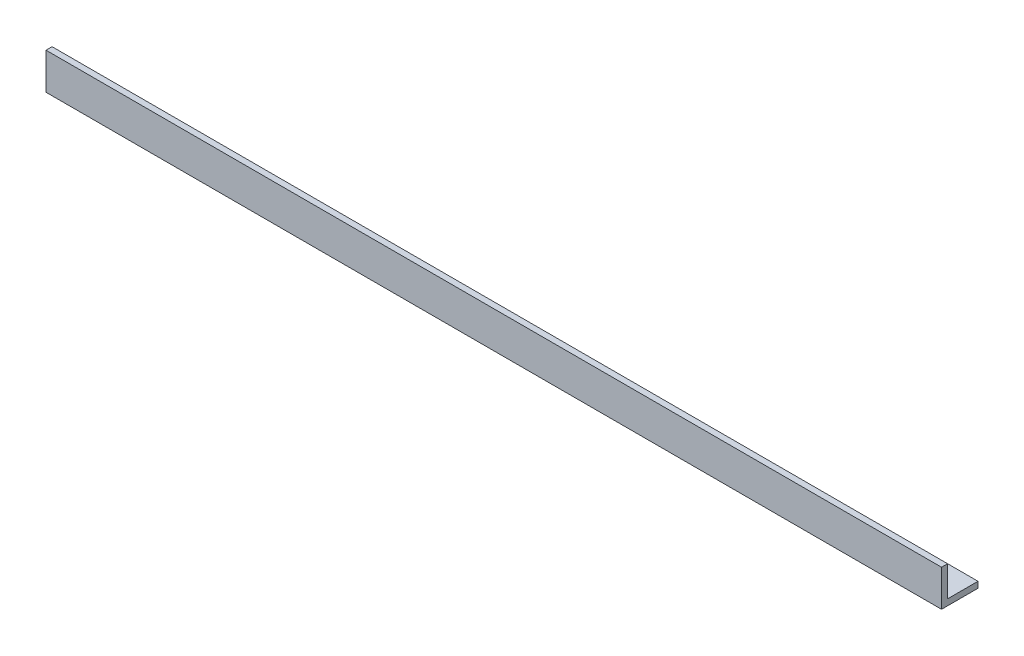
ISO-10303-21;
HEADER;
FILE_DESCRIPTION(('STEP AP214'),'2;1');
FILE_NAME('part.step','',(''),(''),'','','');
FILE_SCHEMA(('AUTOMOTIVE_DESIGN { 1 0 10303 214 1 1 1 1 }'));
ENDSEC;
DATA;
#1=APPLICATION_CONTEXT('core data for automotive mechanical design processes');
#2=APPLICATION_PROTOCOL_DEFINITION('international standard','automotive_design',2000,#1);
#3=PRODUCT_CONTEXT('',#1,'mechanical');
#4=PRODUCT('Part','Part','',(#3));
#5=PRODUCT_RELATED_PRODUCT_CATEGORY('part','',(#4));
#6=PRODUCT_DEFINITION_FORMATION('','',#4);
#7=PRODUCT_DEFINITION_CONTEXT('part definition',#1,'design');
#8=PRODUCT_DEFINITION('design','',#6,#7);
#9=PRODUCT_DEFINITION_SHAPE('','',#8);
#10=(LENGTH_UNIT() NAMED_UNIT(*) SI_UNIT(.MILLI.,.METRE.));
#11=(NAMED_UNIT(*) PLANE_ANGLE_UNIT() SI_UNIT($,.RADIAN.));
#12=(NAMED_UNIT(*) SI_UNIT($,.STERADIAN.) SOLID_ANGLE_UNIT());
#13=UNCERTAINTY_MEASURE_WITH_UNIT(LENGTH_MEASURE(1.E-05),#10,'distance_accuracy_value','');
#14=(GEOMETRIC_REPRESENTATION_CONTEXT(3) GLOBAL_UNCERTAINTY_ASSIGNED_CONTEXT((#13)) GLOBAL_UNIT_ASSIGNED_CONTEXT((#10,
#11,#12)) REPRESENTATION_CONTEXT('',''));
#15=CARTESIAN_POINT('',(0.,0.,0.));
#16=DIRECTION('',(0.,0.,1.));
#17=DIRECTION('',(1.,0.,0.));
#18=AXIS2_PLACEMENT_3D('',#15,#16,#17);
#19=CARTESIAN_POINT('',(-468.,0.,-19.05));
#20=DIRECTION('',(0.,-1.,0.));
#21=DIRECTION('',(0.,0.,-1.));
#22=AXIS2_PLACEMENT_3D('',#19,#20,#21);
#23=PLANE('',#22);
#24=CARTESIAN_POINT('',(-449.45,0.,-11.2735467227539));
#25=DIRECTION('',(0.,1.,0.));
#26=DIRECTION('',(0.,0.,1.));
#27=AXIS2_PLACEMENT_3D('',#24,#25,#26);
#28=CIRCLE('',#27,2.38125000000001);
#29=CARTESIAN_POINT('',(-449.45,0.,-8.89229672275387));
#30=VERTEX_POINT('',#29);
#31=EDGE_CURVE('E222',#30,#30,#28,.T.);
#32=ORIENTED_EDGE('',*,*,#31,.T.);
#33=EDGE_LOOP('',(#32));
#34=FACE_BOUND('',#33,.T.);
#35=CARTESIAN_POINT('',(-413.7,0.,-11.2735467227539));
#36=DIRECTION('',(0.,1.,0.));
#37=DIRECTION('',(0.,0.,1.));
#38=AXIS2_PLACEMENT_3D('',#35,#36,#37);
#39=CIRCLE('',#38,2.38125000000001);
#40=CARTESIAN_POINT('',(-413.7,0.,-8.89229672275387));
#41=VERTEX_POINT('',#40);
#42=EDGE_CURVE('E230',#41,#41,#39,.T.);
#43=ORIENTED_EDGE('',*,*,#42,.T.);
#44=EDGE_LOOP('',(#43));
#45=FACE_BOUND('',#44,.T.);
#46=CARTESIAN_POINT('',(-377.95,0.,-11.2735467227539));
#47=DIRECTION('',(0.,1.,0.));
#48=DIRECTION('',(0.,0.,1.));
#49=AXIS2_PLACEMENT_3D('',#46,#47,#48);
#50=CIRCLE('',#49,2.38125000000001);
#51=CARTESIAN_POINT('',(-377.95,0.,-8.89229672275387));
#52=VERTEX_POINT('',#51);
#53=EDGE_CURVE('E236',#52,#52,#50,.T.);
#54=ORIENTED_EDGE('',*,*,#53,.T.);
#55=EDGE_LOOP('',(#54));
#56=FACE_BOUND('',#55,.T.);
#57=CARTESIAN_POINT('',(-342.2,0.,-11.2735467227539));
#58=DIRECTION('',(0.,1.,0.));
#59=DIRECTION('',(0.,0.,1.));
#60=AXIS2_PLACEMENT_3D('',#57,#58,#59);
#61=CIRCLE('',#60,2.38125000000001);
#62=CARTESIAN_POINT('',(-342.2,0.,-8.89229672275387));
#63=VERTEX_POINT('',#62);
#64=EDGE_CURVE('E242',#63,#63,#61,.T.);
#65=ORIENTED_EDGE('',*,*,#64,.T.);
#66=EDGE_LOOP('',(#65));
#67=FACE_BOUND('',#66,.T.);
#68=CARTESIAN_POINT('',(-306.45,0.,-11.2735467227539));
#69=DIRECTION('',(0.,1.,0.));
#70=DIRECTION('',(0.,0.,1.));
#71=AXIS2_PLACEMENT_3D('',#68,#69,#70);
#72=CIRCLE('',#71,2.38125000000001);
#73=CARTESIAN_POINT('',(-306.45,0.,-8.89229672275387));
#74=VERTEX_POINT('',#73);
#75=EDGE_CURVE('E248',#74,#74,#72,.T.);
#76=ORIENTED_EDGE('',*,*,#75,.T.);
#77=EDGE_LOOP('',(#76));
#78=FACE_BOUND('',#77,.T.);
#79=CARTESIAN_POINT('',(-270.7,0.,-11.2735467227539));
#80=DIRECTION('',(0.,1.,0.));
#81=DIRECTION('',(0.,0.,1.));
#82=AXIS2_PLACEMENT_3D('',#79,#80,#81);
#83=CIRCLE('',#82,2.38125000000001);
#84=CARTESIAN_POINT('',(-270.7,0.,-8.89229672275387));
#85=VERTEX_POINT('',#84);
#86=EDGE_CURVE('E254',#85,#85,#83,.T.);
#87=ORIENTED_EDGE('',*,*,#86,.T.);
#88=EDGE_LOOP('',(#87));
#89=FACE_BOUND('',#88,.T.);
#90=CARTESIAN_POINT('',(-234.95,0.,-11.2735467227539));
#91=DIRECTION('',(0.,1.,0.));
#92=DIRECTION('',(0.,0.,1.));
#93=AXIS2_PLACEMENT_3D('',#90,#91,#92);
#94=CIRCLE('',#93,2.38125000000001);
#95=CARTESIAN_POINT('',(-234.95,0.,-8.89229672275387));
#96=VERTEX_POINT('',#95);
#97=EDGE_CURVE('E260',#96,#96,#94,.T.);
#98=ORIENTED_EDGE('',*,*,#97,.T.);
#99=EDGE_LOOP('',(#98));
#100=FACE_BOUND('',#99,.T.);
#101=CARTESIAN_POINT('',(-199.2,0.,-11.2735467227539));
#102=DIRECTION('',(0.,1.,0.));
#103=DIRECTION('',(0.,0.,1.));
#104=AXIS2_PLACEMENT_3D('',#101,#102,#103);
#105=CIRCLE('',#104,2.38125000000001);
#106=CARTESIAN_POINT('',(-199.2,0.,-8.89229672275387));
#107=VERTEX_POINT('',#106);
#108=EDGE_CURVE('E266',#107,#107,#105,.T.);
#109=ORIENTED_EDGE('',*,*,#108,.T.);
#110=EDGE_LOOP('',(#109));
#111=FACE_BOUND('',#110,.T.);
#112=CARTESIAN_POINT('',(-163.45,0.,-11.2735467227539));
#113=DIRECTION('',(0.,1.,0.));
#114=DIRECTION('',(0.,0.,1.));
#115=AXIS2_PLACEMENT_3D('',#112,#113,#114);
#116=CIRCLE('',#115,2.38125000000001);
#117=CARTESIAN_POINT('',(-163.45,0.,-8.89229672275387));
#118=VERTEX_POINT('',#117);
#119=EDGE_CURVE('E272',#118,#118,#116,.T.);
#120=ORIENTED_EDGE('',*,*,#119,.T.);
#121=EDGE_LOOP('',(#120));
#122=FACE_BOUND('',#121,.T.);
#123=CARTESIAN_POINT('',(-127.7,0.,-11.2735467227539));
#124=DIRECTION('',(0.,1.,0.));
#125=DIRECTION('',(0.,0.,1.));
#126=AXIS2_PLACEMENT_3D('',#123,#124,#125);
#127=CIRCLE('',#126,2.38125000000001);
#128=CARTESIAN_POINT('',(-127.7,0.,-8.89229672275387));
#129=VERTEX_POINT('',#128);
#130=EDGE_CURVE('E278',#129,#129,#127,.T.);
#131=ORIENTED_EDGE('',*,*,#130,.T.);
#132=EDGE_LOOP('',(#131));
#133=FACE_BOUND('',#132,.T.);
#134=CARTESIAN_POINT('',(-91.95,0.,-11.2735467227539));
#135=DIRECTION('',(0.,1.,0.));
#136=DIRECTION('',(0.,0.,1.));
#137=AXIS2_PLACEMENT_3D('',#134,#135,#136);
#138=CIRCLE('',#137,2.38125000000001);
#139=CARTESIAN_POINT('',(-91.95,0.,-8.89229672275387));
#140=VERTEX_POINT('',#139);
#141=EDGE_CURVE('E284',#140,#140,#138,.T.);
#142=ORIENTED_EDGE('',*,*,#141,.T.);
#143=EDGE_LOOP('',(#142));
#144=FACE_BOUND('',#143,.T.);
#145=CARTESIAN_POINT('',(-56.2,0.,-11.2735467227539));
#146=DIRECTION('',(0.,1.,0.));
#147=DIRECTION('',(0.,0.,1.));
#148=AXIS2_PLACEMENT_3D('',#145,#146,#147);
#149=CIRCLE('',#148,2.38125);
#150=CARTESIAN_POINT('',(-56.2,0.,-8.89229672275388));
#151=VERTEX_POINT('',#150);
#152=EDGE_CURVE('E290',#151,#151,#149,.T.);
#153=ORIENTED_EDGE('',*,*,#152,.T.);
#154=EDGE_LOOP('',(#153));
#155=FACE_BOUND('',#154,.T.);
#156=CARTESIAN_POINT('',(-20.4500000000001,0.,-11.2735467227539));
#157=DIRECTION('',(0.,1.,0.));
#158=DIRECTION('',(0.,0.,1.));
#159=AXIS2_PLACEMENT_3D('',#156,#157,#158);
#160=CIRCLE('',#159,2.38125);
#161=CARTESIAN_POINT('',(-20.4500000000001,0.,-8.89229672275388));
#162=VERTEX_POINT('',#161);
#163=EDGE_CURVE('E122',#162,#162,#160,.T.);
#164=ORIENTED_EDGE('',*,*,#163,.T.);
#165=EDGE_LOOP('',(#164));
#166=FACE_BOUND('',#165,.T.);
#167=DIRECTION('',(0.,0.,-1.));
#168=VECTOR('',#167,1.);
#169=CARTESIAN_POINT('',(0.,0.,-19.05));
#170=LINE('',#169,#168);
#171=CARTESIAN_POINT('',(0.,0.,0.));
#172=VERTEX_POINT('',#171);
#173=CARTESIAN_POINT('',(0.,0.,-19.05));
#174=VERTEX_POINT('',#173);
#175=EDGE_CURVE('E118',#172,#174,#170,.T.);
#176=ORIENTED_EDGE('',*,*,#175,.F.);
#177=DIRECTION('',(1.,0.,0.));
#178=VECTOR('',#177,1.);
#179=CARTESIAN_POINT('',(-468.,0.,0.));
#180=LINE('',#179,#178);
#181=CARTESIAN_POINT('',(-468.,0.,0.));
#182=VERTEX_POINT('',#181);
#183=EDGE_CURVE('E11',#182,#172,#180,.T.);
#184=ORIENTED_EDGE('',*,*,#183,.F.);
#185=DIRECTION('',(0.,0.,-1.));
#186=VECTOR('',#185,1.);
#187=CARTESIAN_POINT('',(-468.,0.,-19.05));
#188=LINE('',#187,#186);
#189=CARTESIAN_POINT('',(-468.,0.,-19.05));
#190=VERTEX_POINT('',#189);
#191=EDGE_CURVE('E133',#182,#190,#188,.T.);
#192=ORIENTED_EDGE('',*,*,#191,.T.);
#193=DIRECTION('',(1.,0.,0.));
#194=VECTOR('',#193,1.);
#195=CARTESIAN_POINT('',(-468.,0.,-19.05));
#196=LINE('',#195,#194);
#197=EDGE_CURVE('E36',#190,#174,#196,.T.);
#198=ORIENTED_EDGE('',*,*,#197,.T.);
#199=EDGE_LOOP('',(#176,#184,#192,#198));
#200=FACE_BOUND('',#199,.T.);
#201=ADVANCED_FACE('F33',(#34,#45,#56,#67,#78,#89,#100,#111,#122,#133,#144,#155,#166,#200),#23,.T.);
#202=CARTESIAN_POINT('',(-468.,0.,0.));
#203=DIRECTION('',(0.,0.,1.));
#204=DIRECTION('',(1.,0.,0.));
#205=AXIS2_PLACEMENT_3D('',#202,#203,#204);
#206=PLANE('',#205);
#207=DIRECTION('',(0.,-1.,0.));
#208=VECTOR('',#207,1.);
#209=CARTESIAN_POINT('',(0.,0.,0.));
#210=LINE('',#209,#208);
#211=CARTESIAN_POINT('',(0.,19.05,0.));
#212=VERTEX_POINT('',#211);
#213=EDGE_CURVE('E131',#212,#172,#210,.T.);
#214=ORIENTED_EDGE('',*,*,#213,.F.);
#215=DIRECTION('',(1.,0.,0.));
#216=VECTOR('',#215,1.);
#217=CARTESIAN_POINT('',(-468.,19.05,0.));
#218=LINE('',#217,#216);
#219=CARTESIAN_POINT('',(-468.,19.05,0.));
#220=VERTEX_POINT('',#219);
#221=EDGE_CURVE('E42',#220,#212,#218,.T.);
#222=ORIENTED_EDGE('',*,*,#221,.F.);
#223=DIRECTION('',(0.,-1.,0.));
#224=VECTOR('',#223,1.);
#225=CARTESIAN_POINT('',(-468.,0.,0.));
#226=LINE('',#225,#224);
#227=EDGE_CURVE('E108',#220,#182,#226,.T.);
#228=ORIENTED_EDGE('',*,*,#227,.T.);
#229=ORIENTED_EDGE('',*,*,#183,.T.);
#230=EDGE_LOOP('',(#214,#222,#228,#229));
#231=FACE_BOUND('',#230,.T.);
#232=ADVANCED_FACE('F141',(#231),#206,.T.);
#233=CARTESIAN_POINT('',(-468.,19.05,0.));
#234=DIRECTION('',(0.,1.,0.));
#235=DIRECTION('',(0.,0.,1.));
#236=AXIS2_PLACEMENT_3D('',#233,#234,#235);
#237=PLANE('',#236);
#238=DIRECTION('',(0.,0.,1.));
#239=VECTOR('',#238,1.);
#240=CARTESIAN_POINT('',(0.,19.05,0.));
#241=LINE('',#240,#239);
#242=CARTESIAN_POINT('',(0.,19.05,-3.175));
#243=VERTEX_POINT('',#242);
#244=EDGE_CURVE('E95',#243,#212,#241,.T.);
#245=ORIENTED_EDGE('',*,*,#244,.F.);
#246=DIRECTION('',(1.,0.,0.));
#247=VECTOR('',#246,1.);
#248=CARTESIAN_POINT('',(-468.,19.05,-3.175));
#249=LINE('',#248,#247);
#250=CARTESIAN_POINT('',(-468.,19.05,-3.175));
#251=VERTEX_POINT('',#250);
#252=EDGE_CURVE('E90',#251,#243,#249,.T.);
#253=ORIENTED_EDGE('',*,*,#252,.F.);
#254=DIRECTION('',(0.,0.,1.));
#255=VECTOR('',#254,1.);
#256=CARTESIAN_POINT('',(-468.,19.05,0.));
#257=LINE('',#256,#255);
#258=EDGE_CURVE('E93',#251,#220,#257,.T.);
#259=ORIENTED_EDGE('',*,*,#258,.T.);
#260=ORIENTED_EDGE('',*,*,#221,.T.);
#261=EDGE_LOOP('',(#245,#253,#259,#260));
#262=FACE_BOUND('',#261,.T.);
#263=ADVANCED_FACE('F92',(#262),#237,.T.);
#264=CARTESIAN_POINT('',(-468.,19.05,-3.175));
#265=DIRECTION('',(0.,0.,-1.));
#266=DIRECTION('',(0.,1.,0.));
#267=AXIS2_PLACEMENT_3D('',#264,#265,#266);
#268=PLANE('',#267);
#269=DIRECTION('',(0.,1.,0.));
#270=VECTOR('',#269,1.);
#271=CARTESIAN_POINT('',(0.,19.05,-3.175));
#272=LINE('',#271,#270);
#273=CARTESIAN_POINT('',(0.,3.175,-3.175));
#274=VERTEX_POINT('',#273);
#275=EDGE_CURVE('E128',#274,#243,#272,.T.);
#276=ORIENTED_EDGE('',*,*,#275,.F.);
#277=DIRECTION('',(1.,0.,0.));
#278=VECTOR('',#277,1.);
#279=CARTESIAN_POINT('',(-468.,3.175,-3.175));
#280=LINE('',#279,#278);
#281=CARTESIAN_POINT('',(-468.,3.175,-3.175));
#282=VERTEX_POINT('',#281);
#283=EDGE_CURVE('E100',#282,#274,#280,.T.);
#284=ORIENTED_EDGE('',*,*,#283,.F.);
#285=DIRECTION('',(0.,1.,0.));
#286=VECTOR('',#285,1.);
#287=CARTESIAN_POINT('',(-468.,19.05,-3.175));
#288=LINE('',#287,#286);
#289=EDGE_CURVE('E106',#282,#251,#288,.T.);
#290=ORIENTED_EDGE('',*,*,#289,.T.);
#291=ORIENTED_EDGE('',*,*,#252,.T.);
#292=EDGE_LOOP('',(#276,#284,#290,#291));
#293=FACE_BOUND('',#292,.T.);
#294=ADVANCED_FACE('F110',(#293),#268,.T.);
#295=CARTESIAN_POINT('',(-468.,3.175,-3.175));
#296=DIRECTION('',(0.,1.,0.));
#297=DIRECTION('',(0.,0.,1.));
#298=AXIS2_PLACEMENT_3D('',#295,#296,#297);
#299=PLANE('',#298);
#300=CARTESIAN_POINT('',(-449.45,3.175,-11.2735467227539));
#301=DIRECTION('',(0.,1.,0.));
#302=DIRECTION('',(0.,0.,1.));
#303=AXIS2_PLACEMENT_3D('',#300,#301,#302);
#304=CIRCLE('',#303,2.38125000000001);
#305=CARTESIAN_POINT('',(-449.45,3.175,-8.89229672275387));
#306=VERTEX_POINT('',#305);
#307=EDGE_CURVE('E225',#306,#306,#304,.T.);
#308=ORIENTED_EDGE('',*,*,#307,.F.);
#309=EDGE_LOOP('',(#308));
#310=FACE_BOUND('',#309,.T.);
#311=CARTESIAN_POINT('',(-413.7,3.175,-11.2735467227539));
#312=DIRECTION('',(0.,1.,0.));
#313=DIRECTION('',(0.,0.,1.));
#314=AXIS2_PLACEMENT_3D('',#311,#312,#313);
#315=CIRCLE('',#314,2.38125000000001);
#316=CARTESIAN_POINT('',(-413.7,3.175,-8.89229672275387));
#317=VERTEX_POINT('',#316);
#318=EDGE_CURVE('E227',#317,#317,#315,.T.);
#319=ORIENTED_EDGE('',*,*,#318,.F.);
#320=EDGE_LOOP('',(#319));
#321=FACE_BOUND('',#320,.T.);
#322=CARTESIAN_POINT('',(-377.95,3.175,-11.2735467227539));
#323=DIRECTION('',(0.,1.,0.));
#324=DIRECTION('',(0.,0.,1.));
#325=AXIS2_PLACEMENT_3D('',#322,#323,#324);
#326=CIRCLE('',#325,2.38125000000001);
#327=CARTESIAN_POINT('',(-377.95,3.175,-8.89229672275387));
#328=VERTEX_POINT('',#327);
#329=EDGE_CURVE('E233',#328,#328,#326,.T.);
#330=ORIENTED_EDGE('',*,*,#329,.F.);
#331=EDGE_LOOP('',(#330));
#332=FACE_BOUND('',#331,.T.);
#333=CARTESIAN_POINT('',(-342.2,3.175,-11.2735467227539));
#334=DIRECTION('',(0.,1.,0.));
#335=DIRECTION('',(0.,0.,1.));
#336=AXIS2_PLACEMENT_3D('',#333,#334,#335);
#337=CIRCLE('',#336,2.38125000000001);
#338=CARTESIAN_POINT('',(-342.2,3.175,-8.89229672275387));
#339=VERTEX_POINT('',#338);
#340=EDGE_CURVE('E239',#339,#339,#337,.T.);
#341=ORIENTED_EDGE('',*,*,#340,.F.);
#342=EDGE_LOOP('',(#341));
#343=FACE_BOUND('',#342,.T.);
#344=CARTESIAN_POINT('',(-306.45,3.175,-11.2735467227539));
#345=DIRECTION('',(0.,1.,0.));
#346=DIRECTION('',(0.,0.,1.));
#347=AXIS2_PLACEMENT_3D('',#344,#345,#346);
#348=CIRCLE('',#347,2.38125000000001);
#349=CARTESIAN_POINT('',(-306.45,3.175,-8.89229672275387));
#350=VERTEX_POINT('',#349);
#351=EDGE_CURVE('E245',#350,#350,#348,.T.);
#352=ORIENTED_EDGE('',*,*,#351,.F.);
#353=EDGE_LOOP('',(#352));
#354=FACE_BOUND('',#353,.T.);
#355=CARTESIAN_POINT('',(-270.7,3.175,-11.2735467227539));
#356=DIRECTION('',(0.,1.,0.));
#357=DIRECTION('',(0.,0.,1.));
#358=AXIS2_PLACEMENT_3D('',#355,#356,#357);
#359=CIRCLE('',#358,2.38125000000001);
#360=CARTESIAN_POINT('',(-270.7,3.175,-8.89229672275387));
#361=VERTEX_POINT('',#360);
#362=EDGE_CURVE('E251',#361,#361,#359,.T.);
#363=ORIENTED_EDGE('',*,*,#362,.F.);
#364=EDGE_LOOP('',(#363));
#365=FACE_BOUND('',#364,.T.);
#366=CARTESIAN_POINT('',(-234.95,3.175,-11.2735467227539));
#367=DIRECTION('',(0.,1.,0.));
#368=DIRECTION('',(0.,0.,1.));
#369=AXIS2_PLACEMENT_3D('',#366,#367,#368);
#370=CIRCLE('',#369,2.38125000000001);
#371=CARTESIAN_POINT('',(-234.95,3.175,-8.89229672275387));
#372=VERTEX_POINT('',#371);
#373=EDGE_CURVE('E257',#372,#372,#370,.T.);
#374=ORIENTED_EDGE('',*,*,#373,.F.);
#375=EDGE_LOOP('',(#374));
#376=FACE_BOUND('',#375,.T.);
#377=CARTESIAN_POINT('',(-199.2,3.175,-11.2735467227539));
#378=DIRECTION('',(0.,1.,0.));
#379=DIRECTION('',(0.,0.,1.));
#380=AXIS2_PLACEMENT_3D('',#377,#378,#379);
#381=CIRCLE('',#380,2.38125000000001);
#382=CARTESIAN_POINT('',(-199.2,3.175,-8.89229672275387));
#383=VERTEX_POINT('',#382);
#384=EDGE_CURVE('E263',#383,#383,#381,.T.);
#385=ORIENTED_EDGE('',*,*,#384,.F.);
#386=EDGE_LOOP('',(#385));
#387=FACE_BOUND('',#386,.T.);
#388=CARTESIAN_POINT('',(-163.45,3.175,-11.2735467227539));
#389=DIRECTION('',(0.,1.,0.));
#390=DIRECTION('',(0.,0.,1.));
#391=AXIS2_PLACEMENT_3D('',#388,#389,#390);
#392=CIRCLE('',#391,2.38125000000001);
#393=CARTESIAN_POINT('',(-163.45,3.175,-8.89229672275387));
#394=VERTEX_POINT('',#393);
#395=EDGE_CURVE('E269',#394,#394,#392,.T.);
#396=ORIENTED_EDGE('',*,*,#395,.F.);
#397=EDGE_LOOP('',(#396));
#398=FACE_BOUND('',#397,.T.);
#399=CARTESIAN_POINT('',(-127.7,3.175,-11.2735467227539));
#400=DIRECTION('',(0.,1.,0.));
#401=DIRECTION('',(0.,0.,1.));
#402=AXIS2_PLACEMENT_3D('',#399,#400,#401);
#403=CIRCLE('',#402,2.38125000000001);
#404=CARTESIAN_POINT('',(-127.7,3.175,-8.89229672275387));
#405=VERTEX_POINT('',#404);
#406=EDGE_CURVE('E275',#405,#405,#403,.T.);
#407=ORIENTED_EDGE('',*,*,#406,.F.);
#408=EDGE_LOOP('',(#407));
#409=FACE_BOUND('',#408,.T.);
#410=CARTESIAN_POINT('',(-91.95,3.175,-11.2735467227539));
#411=DIRECTION('',(0.,1.,0.));
#412=DIRECTION('',(0.,0.,1.));
#413=AXIS2_PLACEMENT_3D('',#410,#411,#412);
#414=CIRCLE('',#413,2.38125000000001);
#415=CARTESIAN_POINT('',(-91.95,3.175,-8.89229672275387));
#416=VERTEX_POINT('',#415);
#417=EDGE_CURVE('E281',#416,#416,#414,.T.);
#418=ORIENTED_EDGE('',*,*,#417,.F.);
#419=EDGE_LOOP('',(#418));
#420=FACE_BOUND('',#419,.T.);
#421=CARTESIAN_POINT('',(-56.2,3.175,-11.2735467227539));
#422=DIRECTION('',(0.,1.,0.));
#423=DIRECTION('',(0.,0.,1.));
#424=AXIS2_PLACEMENT_3D('',#421,#422,#423);
#425=CIRCLE('',#424,2.38125);
#426=CARTESIAN_POINT('',(-56.2,3.175,-8.89229672275388));
#427=VERTEX_POINT('',#426);
#428=EDGE_CURVE('E287',#427,#427,#425,.T.);
#429=ORIENTED_EDGE('',*,*,#428,.F.);
#430=EDGE_LOOP('',(#429));
#431=FACE_BOUND('',#430,.T.);
#432=CARTESIAN_POINT('',(-20.4500000000001,3.175,-11.2735467227539));
#433=DIRECTION('',(0.,1.,0.));
#434=DIRECTION('',(0.,0.,1.));
#435=AXIS2_PLACEMENT_3D('',#432,#433,#434);
#436=CIRCLE('',#435,2.38125);
#437=CARTESIAN_POINT('',(-20.4500000000001,3.175,-8.89229672275388));
#438=VERTEX_POINT('',#437);
#439=EDGE_CURVE('E293',#438,#438,#436,.T.);
#440=ORIENTED_EDGE('',*,*,#439,.F.);
#441=EDGE_LOOP('',(#440));
#442=FACE_BOUND('',#441,.T.);
#443=DIRECTION('',(0.,0.,1.));
#444=VECTOR('',#443,1.);
#445=CARTESIAN_POINT('',(0.,3.175,-3.175));
#446=LINE('',#445,#444);
#447=CARTESIAN_POINT('',(0.,3.175,-19.05));
#448=VERTEX_POINT('',#447);
#449=EDGE_CURVE('E125',#448,#274,#446,.T.);
#450=ORIENTED_EDGE('',*,*,#449,.F.);
#451=DIRECTION('',(1.,0.,0.));
#452=VECTOR('',#451,1.);
#453=CARTESIAN_POINT('',(-468.,3.175,-19.05));
#454=LINE('',#453,#452);
#455=CARTESIAN_POINT('',(-468.,3.175,-19.05));
#456=VERTEX_POINT('',#455);
#457=EDGE_CURVE('E136',#456,#448,#454,.T.);
#458=ORIENTED_EDGE('',*,*,#457,.F.);
#459=DIRECTION('',(0.,0.,1.));
#460=VECTOR('',#459,1.);
#461=CARTESIAN_POINT('',(-468.,3.175,-3.175));
#462=LINE('',#461,#460);
#463=EDGE_CURVE('E111',#456,#282,#462,.T.);
#464=ORIENTED_EDGE('',*,*,#463,.T.);
#465=ORIENTED_EDGE('',*,*,#283,.T.);
#466=EDGE_LOOP('',(#450,#458,#464,#465));
#467=FACE_BOUND('',#466,.T.);
#468=ADVANCED_FACE('F155',(#310,#321,#332,#343,#354,#365,#376,#387,#398,#409,#420,#431,#442,
#467),#299,.T.);
#469=CARTESIAN_POINT('',(-468.,3.175,-19.05));
#470=DIRECTION('',(0.,0.,-1.));
#471=DIRECTION('',(0.,1.,0.));
#472=AXIS2_PLACEMENT_3D('',#469,#470,#471);
#473=PLANE('',#472);
#474=DIRECTION('',(0.,1.,0.));
#475=VECTOR('',#474,1.);
#476=CARTESIAN_POINT('',(0.,3.175,-19.05));
#477=LINE('',#476,#475);
#478=EDGE_CURVE('E121',#174,#448,#477,.T.);
#479=ORIENTED_EDGE('',*,*,#478,.F.);
#480=ORIENTED_EDGE('',*,*,#197,.F.);
#481=DIRECTION('',(0.,1.,0.));
#482=VECTOR('',#481,1.);
#483=CARTESIAN_POINT('',(-468.,3.175,-19.05));
#484=LINE('',#483,#482);
#485=EDGE_CURVE('E113',#190,#456,#484,.T.);
#486=ORIENTED_EDGE('',*,*,#485,.T.);
#487=ORIENTED_EDGE('',*,*,#457,.T.);
#488=EDGE_LOOP('',(#479,#480,#486,#487));
#489=FACE_BOUND('',#488,.T.);
#490=ADVANCED_FACE('F138',(#489),#473,.T.);
#491=CARTESIAN_POINT('',(-468.,0.,0.));
#492=DIRECTION('',(-1.,0.,0.));
#493=DIRECTION('',(0.,0.,1.));
#494=AXIS2_PLACEMENT_3D('',#491,#492,#493);
#495=PLANE('',#494);
#496=ORIENTED_EDGE('',*,*,#191,.F.);
#497=ORIENTED_EDGE('',*,*,#227,.F.);
#498=ORIENTED_EDGE('',*,*,#258,.F.);
#499=ORIENTED_EDGE('',*,*,#289,.F.);
#500=ORIENTED_EDGE('',*,*,#463,.F.);
#501=ORIENTED_EDGE('',*,*,#485,.F.);
#502=EDGE_LOOP('',(#496,#497,#498,#499,#500,#501));
#503=FACE_BOUND('',#502,.T.);
#504=ADVANCED_FACE('F104',(#503),#495,.T.);
#505=CARTESIAN_POINT('',(0.,0.,0.));
#506=DIRECTION('',(-1.,0.,0.));
#507=DIRECTION('',(0.,0.,1.));
#508=AXIS2_PLACEMENT_3D('',#505,#506,#507);
#509=PLANE('',#508);
#510=ORIENTED_EDGE('',*,*,#175,.T.);
#511=ORIENTED_EDGE('',*,*,#478,.T.);
#512=ORIENTED_EDGE('',*,*,#449,.T.);
#513=ORIENTED_EDGE('',*,*,#275,.T.);
#514=ORIENTED_EDGE('',*,*,#244,.T.);
#515=ORIENTED_EDGE('',*,*,#213,.T.);
#516=EDGE_LOOP('',(#510,#511,#512,#513,#514,#515));
#517=FACE_BOUND('',#516,.T.);
#518=ADVANCED_FACE('F140',(#517),#509,.F.);
#519=CARTESIAN_POINT('',(-20.4500000000001,0.,-11.2735467227539));
#520=DIRECTION('',(0.,1.,0.));
#521=DIRECTION('',(0.,0.,1.));
#522=AXIS2_PLACEMENT_3D('',#519,#520,#521);
#523=CYLINDRICAL_SURFACE('',#522,2.38125);
#524=ORIENTED_EDGE('',*,*,#163,.F.);
#525=EDGE_LOOP('',(#524));
#526=FACE_BOUND('',#525,.T.);
#527=ORIENTED_EDGE('',*,*,#439,.T.);
#528=EDGE_LOOP('',(#527));
#529=FACE_BOUND('',#528,.T.);
#530=ADVANCED_FACE('F165',(#526,#529),#523,.F.);
#531=CARTESIAN_POINT('',(-56.2,0.,-11.2735467227539));
#532=DIRECTION('',(0.,1.,0.));
#533=DIRECTION('',(0.,0.,1.));
#534=AXIS2_PLACEMENT_3D('',#531,#532,#533);
#535=CYLINDRICAL_SURFACE('',#534,2.38125);
#536=ORIENTED_EDGE('',*,*,#152,.F.);
#537=EDGE_LOOP('',(#536));
#538=FACE_BOUND('',#537,.T.);
#539=ORIENTED_EDGE('',*,*,#428,.T.);
#540=EDGE_LOOP('',(#539));
#541=FACE_BOUND('',#540,.T.);
#542=ADVANCED_FACE('F169',(#538,#541),#535,.F.);
#543=CARTESIAN_POINT('',(-91.95,0.,-11.2735467227539));
#544=DIRECTION('',(0.,1.,0.));
#545=DIRECTION('',(0.,0.,1.));
#546=AXIS2_PLACEMENT_3D('',#543,#544,#545);
#547=CYLINDRICAL_SURFACE('',#546,2.38125000000001);
#548=ORIENTED_EDGE('',*,*,#141,.F.);
#549=EDGE_LOOP('',(#548));
#550=FACE_BOUND('',#549,.T.);
#551=ORIENTED_EDGE('',*,*,#417,.T.);
#552=EDGE_LOOP('',(#551));
#553=FACE_BOUND('',#552,.T.);
#554=ADVANCED_FACE('F173',(#550,#553),#547,.F.);
#555=CARTESIAN_POINT('',(-127.7,0.,-11.2735467227539));
#556=DIRECTION('',(0.,1.,0.));
#557=DIRECTION('',(0.,0.,1.));
#558=AXIS2_PLACEMENT_3D('',#555,#556,#557);
#559=CYLINDRICAL_SURFACE('',#558,2.38125000000001);
#560=ORIENTED_EDGE('',*,*,#130,.F.);
#561=EDGE_LOOP('',(#560));
#562=FACE_BOUND('',#561,.T.);
#563=ORIENTED_EDGE('',*,*,#406,.T.);
#564=EDGE_LOOP('',(#563));
#565=FACE_BOUND('',#564,.T.);
#566=ADVANCED_FACE('F177',(#562,#565),#559,.F.);
#567=CARTESIAN_POINT('',(-163.45,0.,-11.2735467227539));
#568=DIRECTION('',(0.,1.,0.));
#569=DIRECTION('',(0.,0.,1.));
#570=AXIS2_PLACEMENT_3D('',#567,#568,#569);
#571=CYLINDRICAL_SURFACE('',#570,2.38125000000001);
#572=ORIENTED_EDGE('',*,*,#119,.F.);
#573=EDGE_LOOP('',(#572));
#574=FACE_BOUND('',#573,.T.);
#575=ORIENTED_EDGE('',*,*,#395,.T.);
#576=EDGE_LOOP('',(#575));
#577=FACE_BOUND('',#576,.T.);
#578=ADVANCED_FACE('F181',(#574,#577),#571,.F.);
#579=CARTESIAN_POINT('',(-199.2,0.,-11.2735467227539));
#580=DIRECTION('',(0.,1.,0.));
#581=DIRECTION('',(0.,0.,1.));
#582=AXIS2_PLACEMENT_3D('',#579,#580,#581);
#583=CYLINDRICAL_SURFACE('',#582,2.38125000000001);
#584=ORIENTED_EDGE('',*,*,#108,.F.);
#585=EDGE_LOOP('',(#584));
#586=FACE_BOUND('',#585,.T.);
#587=ORIENTED_EDGE('',*,*,#384,.T.);
#588=EDGE_LOOP('',(#587));
#589=FACE_BOUND('',#588,.T.);
#590=ADVANCED_FACE('F185',(#586,#589),#583,.F.);
#591=CARTESIAN_POINT('',(-234.95,0.,-11.2735467227539));
#592=DIRECTION('',(0.,1.,0.));
#593=DIRECTION('',(0.,0.,1.));
#594=AXIS2_PLACEMENT_3D('',#591,#592,#593);
#595=CYLINDRICAL_SURFACE('',#594,2.38125000000001);
#596=ORIENTED_EDGE('',*,*,#97,.F.);
#597=EDGE_LOOP('',(#596));
#598=FACE_BOUND('',#597,.T.);
#599=ORIENTED_EDGE('',*,*,#373,.T.);
#600=EDGE_LOOP('',(#599));
#601=FACE_BOUND('',#600,.T.);
#602=ADVANCED_FACE('F189',(#598,#601),#595,.F.);
#603=CARTESIAN_POINT('',(-270.7,0.,-11.2735467227539));
#604=DIRECTION('',(0.,1.,0.));
#605=DIRECTION('',(0.,0.,1.));
#606=AXIS2_PLACEMENT_3D('',#603,#604,#605);
#607=CYLINDRICAL_SURFACE('',#606,2.38125000000001);
#608=ORIENTED_EDGE('',*,*,#86,.F.);
#609=EDGE_LOOP('',(#608));
#610=FACE_BOUND('',#609,.T.);
#611=ORIENTED_EDGE('',*,*,#362,.T.);
#612=EDGE_LOOP('',(#611));
#613=FACE_BOUND('',#612,.T.);
#614=ADVANCED_FACE('F193',(#610,#613),#607,.F.);
#615=CARTESIAN_POINT('',(-306.45,0.,-11.2735467227539));
#616=DIRECTION('',(0.,1.,0.));
#617=DIRECTION('',(0.,0.,1.));
#618=AXIS2_PLACEMENT_3D('',#615,#616,#617);
#619=CYLINDRICAL_SURFACE('',#618,2.38125000000001);
#620=ORIENTED_EDGE('',*,*,#75,.F.);
#621=EDGE_LOOP('',(#620));
#622=FACE_BOUND('',#621,.T.);
#623=ORIENTED_EDGE('',*,*,#351,.T.);
#624=EDGE_LOOP('',(#623));
#625=FACE_BOUND('',#624,.T.);
#626=ADVANCED_FACE('F197',(#622,#625),#619,.F.);
#627=CARTESIAN_POINT('',(-342.2,0.,-11.2735467227539));
#628=DIRECTION('',(0.,1.,0.));
#629=DIRECTION('',(0.,0.,1.));
#630=AXIS2_PLACEMENT_3D('',#627,#628,#629);
#631=CYLINDRICAL_SURFACE('',#630,2.38125000000001);
#632=ORIENTED_EDGE('',*,*,#64,.F.);
#633=EDGE_LOOP('',(#632));
#634=FACE_BOUND('',#633,.T.);
#635=ORIENTED_EDGE('',*,*,#340,.T.);
#636=EDGE_LOOP('',(#635));
#637=FACE_BOUND('',#636,.T.);
#638=ADVANCED_FACE('F201',(#634,#637),#631,.F.);
#639=CARTESIAN_POINT('',(-377.95,0.,-11.2735467227539));
#640=DIRECTION('',(0.,1.,0.));
#641=DIRECTION('',(0.,0.,1.));
#642=AXIS2_PLACEMENT_3D('',#639,#640,#641);
#643=CYLINDRICAL_SURFACE('',#642,2.38125000000001);
#644=ORIENTED_EDGE('',*,*,#53,.F.);
#645=EDGE_LOOP('',(#644));
#646=FACE_BOUND('',#645,.T.);
#647=ORIENTED_EDGE('',*,*,#329,.T.);
#648=EDGE_LOOP('',(#647));
#649=FACE_BOUND('',#648,.T.);
#650=ADVANCED_FACE('F205',(#646,#649),#643,.F.);
#651=CARTESIAN_POINT('',(-413.7,0.,-11.2735467227539));
#652=DIRECTION('',(0.,1.,0.));
#653=DIRECTION('',(0.,0.,1.));
#654=AXIS2_PLACEMENT_3D('',#651,#652,#653);
#655=CYLINDRICAL_SURFACE('',#654,2.38125000000001);
#656=ORIENTED_EDGE('',*,*,#42,.F.);
#657=EDGE_LOOP('',(#656));
#658=FACE_BOUND('',#657,.T.);
#659=ORIENTED_EDGE('',*,*,#318,.T.);
#660=EDGE_LOOP('',(#659));
#661=FACE_BOUND('',#660,.T.);
#662=ADVANCED_FACE('F209',(#658,#661),#655,.F.);
#663=CARTESIAN_POINT('',(-449.45,0.,-11.2735467227539));
#664=DIRECTION('',(0.,1.,0.));
#665=DIRECTION('',(0.,0.,1.));
#666=AXIS2_PLACEMENT_3D('',#663,#664,#665);
#667=CYLINDRICAL_SURFACE('',#666,2.38125000000001);
#668=ORIENTED_EDGE('',*,*,#31,.F.);
#669=EDGE_LOOP('',(#668));
#670=FACE_BOUND('',#669,.T.);
#671=ORIENTED_EDGE('',*,*,#307,.T.);
#672=EDGE_LOOP('',(#671));
#673=FACE_BOUND('',#672,.T.);
#674=ADVANCED_FACE('F213',(#670,#673),#667,.F.);
#675=CLOSED_SHELL('',(#201,#232,#263,#294,#468,#490,#504,#518,#530,#542,#554,#566,#578,#590,
#602,#614,#626,#638,#650,#662,#674));
#676=MANIFOLD_SOLID_BREP('B2',#675);
#677=ADVANCED_BREP_SHAPE_REPRESENTATION('',(#18,#676),#14);
#678=SHAPE_DEFINITION_REPRESENTATION(#9,#677);
ENDSEC;
END-ISO-10303-21;
